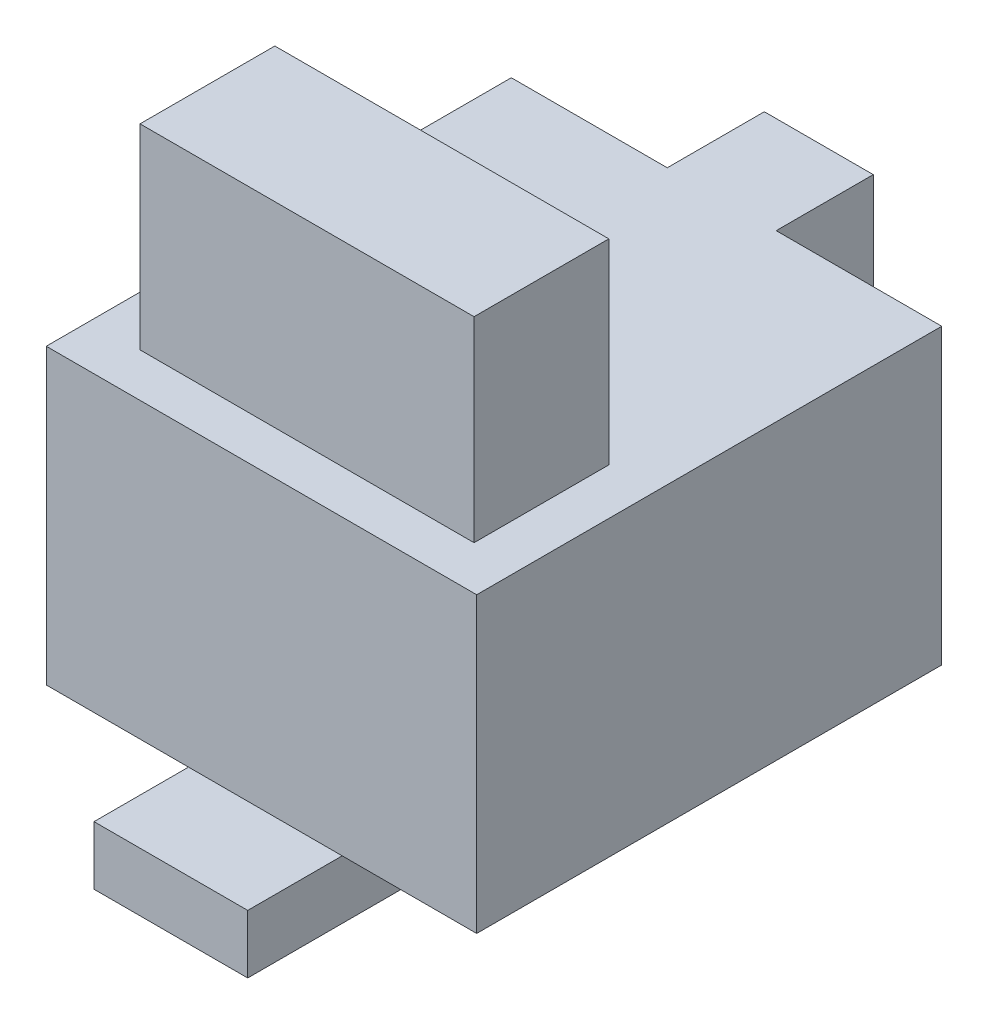
ISO-10303-21;
HEADER;
FILE_DESCRIPTION(('STEP AP214'),'2;1');
FILE_NAME('part.step','',(''),(''),'','','');
FILE_SCHEMA(('AUTOMOTIVE_DESIGN { 1 0 10303 214 1 1 1 1 }'));
ENDSEC;
DATA;
#1=APPLICATION_CONTEXT('core data for automotive mechanical design processes');
#2=APPLICATION_PROTOCOL_DEFINITION('international standard','automotive_design',2000,#1);
#3=PRODUCT_CONTEXT('',#1,'mechanical');
#4=PRODUCT('Part','Part','',(#3));
#5=PRODUCT_RELATED_PRODUCT_CATEGORY('part','',(#4));
#6=PRODUCT_DEFINITION_FORMATION('','',#4);
#7=PRODUCT_DEFINITION_CONTEXT('part definition',#1,'design');
#8=PRODUCT_DEFINITION('design','',#6,#7);
#9=PRODUCT_DEFINITION_SHAPE('','',#8);
#10=(LENGTH_UNIT() NAMED_UNIT(*) SI_UNIT(.MILLI.,.METRE.));
#11=(NAMED_UNIT(*) PLANE_ANGLE_UNIT() SI_UNIT($,.RADIAN.));
#12=(NAMED_UNIT(*) SI_UNIT($,.STERADIAN.) SOLID_ANGLE_UNIT());
#13=UNCERTAINTY_MEASURE_WITH_UNIT(LENGTH_MEASURE(1.E-05),#10,'distance_accuracy_value','');
#14=(GEOMETRIC_REPRESENTATION_CONTEXT(3) GLOBAL_UNCERTAINTY_ASSIGNED_CONTEXT((#13)) GLOBAL_UNIT_ASSIGNED_CONTEXT((#10,
#11,#12)) REPRESENTATION_CONTEXT('',''));
#15=CARTESIAN_POINT('',(0.,0.,0.));
#16=DIRECTION('',(0.,0.,1.));
#17=DIRECTION('',(1.,0.,0.));
#18=AXIS2_PLACEMENT_3D('',#15,#16,#17);
#19=CARTESIAN_POINT('',(0.,27.2,0.));
#20=DIRECTION('',(0.,-1.,0.));
#21=DIRECTION('',(0.,0.,-1.));
#22=AXIS2_PLACEMENT_3D('',#19,#20,#21);
#23=PLANE('',#22);
#24=DIRECTION('',(0.,0.,1.));
#25=VECTOR('',#24,1.);
#26=CARTESIAN_POINT('',(-19.955,27.2,-21.56));
#27=LINE('',#26,#25);
#28=CARTESIAN_POINT('',(-19.955,27.2,-21.56));
#29=VERTEX_POINT('',#28);
#30=CARTESIAN_POINT('',(-19.955,27.2,21.56));
#31=VERTEX_POINT('',#30);
#32=EDGE_CURVE('E242',#29,#31,#27,.T.);
#33=ORIENTED_EDGE('',*,*,#32,.T.);
#34=DIRECTION('',(1.,0.,0.));
#35=VECTOR('',#34,1.);
#36=CARTESIAN_POINT('',(19.955,27.2,21.56));
#37=LINE('',#36,#35);
#38=CARTESIAN_POINT('',(19.955,27.2,21.56));
#39=VERTEX_POINT('',#38);
#40=EDGE_CURVE('E245',#31,#39,#37,.T.);
#41=ORIENTED_EDGE('',*,*,#40,.T.);
#42=DIRECTION('',(0.,0.,-1.));
#43=VECTOR('',#42,1.);
#44=CARTESIAN_POINT('',(19.955,27.2,-21.56));
#45=LINE('',#44,#43);
#46=CARTESIAN_POINT('',(19.955,27.2,-21.56));
#47=VERTEX_POINT('',#46);
#48=EDGE_CURVE('E248',#39,#47,#45,.T.);
#49=ORIENTED_EDGE('',*,*,#48,.T.);
#50=DIRECTION('',(-1.,0.,0.));
#51=VECTOR('',#50,1.);
#52=CARTESIAN_POINT('',(19.955,27.2,-21.56));
#53=LINE('',#52,#51);
#54=CARTESIAN_POINT('',(4.60499999999999,27.2,-21.56));
#55=VERTEX_POINT('',#54);
#56=EDGE_CURVE('E251',#47,#55,#53,.T.);
#57=ORIENTED_EDGE('',*,*,#56,.T.);
#58=DIRECTION('',(0.,0.,1.));
#59=VECTOR('',#58,1.);
#60=CARTESIAN_POINT('',(4.605,27.2,-30.56));
#61=LINE('',#60,#59);
#62=CARTESIAN_POINT('',(4.605,27.2,-30.56));
#63=VERTEX_POINT('',#62);
#64=EDGE_CURVE('E235',#63,#55,#61,.T.);
#65=ORIENTED_EDGE('',*,*,#64,.F.);
#66=DIRECTION('',(1.,0.,0.));
#67=VECTOR('',#66,1.);
#68=CARTESIAN_POINT('',(-5.495,27.2,-30.56));
#69=LINE('',#68,#67);
#70=CARTESIAN_POINT('',(-5.495,27.2,-30.56));
#71=VERTEX_POINT('',#70);
#72=EDGE_CURVE('E215',#71,#63,#69,.T.);
#73=ORIENTED_EDGE('',*,*,#72,.F.);
#74=DIRECTION('',(0.,0.,1.));
#75=VECTOR('',#74,1.);
#76=CARTESIAN_POINT('',(-5.495,27.2,-30.56));
#77=LINE('',#76,#75);
#78=CARTESIAN_POINT('',(-5.495,27.2,-21.56));
#79=VERTEX_POINT('',#78);
#80=EDGE_CURVE('E238',#71,#79,#77,.T.);
#81=ORIENTED_EDGE('',*,*,#80,.T.);
#82=EDGE_CURVE('E250',#79,#29,#53,.T.);
#83=ORIENTED_EDGE('',*,*,#82,.T.);
#84=EDGE_LOOP('',(#33,#41,#49,#57,#65,#73,#81,#83));
#85=FACE_BOUND('',#84,.T.);
#86=DIRECTION('',(0.,0.,1.));
#87=VECTOR('',#86,1.);
#88=CARTESIAN_POINT('',(-15.315,27.2,5.0046398551843));
#89=LINE('',#88,#87);
#90=CARTESIAN_POINT('',(-15.315,27.2,5.0046398551843));
#91=VERTEX_POINT('',#90);
#92=CARTESIAN_POINT('',(-15.315,27.2,17.5046398551843));
#93=VERTEX_POINT('',#92);
#94=EDGE_CURVE('E174',#91,#93,#89,.T.);
#95=ORIENTED_EDGE('',*,*,#94,.F.);
#96=DIRECTION('',(-1.,0.,0.));
#97=VECTOR('',#96,1.);
#98=CARTESIAN_POINT('',(-15.315,27.2,5.0046398551843));
#99=LINE('',#98,#97);
#100=CARTESIAN_POINT('',(15.655,27.2,5.0046398551843));
#101=VERTEX_POINT('',#100);
#102=EDGE_CURVE('E171',#101,#91,#99,.T.);
#103=ORIENTED_EDGE('',*,*,#102,.F.);
#104=DIRECTION('',(0.,0.,-1.));
#105=VECTOR('',#104,1.);
#106=CARTESIAN_POINT('',(15.655,27.2,5.0046398551843));
#107=LINE('',#106,#105);
#108=CARTESIAN_POINT('',(15.655,27.2,17.5046398551843));
#109=VERTEX_POINT('',#108);
#110=EDGE_CURVE('E55',#109,#101,#107,.T.);
#111=ORIENTED_EDGE('',*,*,#110,.F.);
#112=DIRECTION('',(1.,0.,0.));
#113=VECTOR('',#112,1.);
#114=CARTESIAN_POINT('',(-15.315,27.2,17.5046398551843));
#115=LINE('',#114,#113);
#116=EDGE_CURVE('E50',#93,#109,#115,.T.);
#117=ORIENTED_EDGE('',*,*,#116,.F.);
#118=EDGE_LOOP('',(#95,#103,#111,#117));
#119=FACE_BOUND('',#118,.T.);
#120=ADVANCED_FACE('F33',(#85,#119),#23,.F.);
#121=CARTESIAN_POINT('',(19.955,27.2,-21.56));
#122=DIRECTION('',(0.,0.,1.));
#123=DIRECTION('',(1.,0.,0.));
#124=AXIS2_PLACEMENT_3D('',#121,#122,#123);
#125=PLANE('',#124);
#126=DIRECTION('',(0.,1.,0.));
#127=VECTOR('',#126,1.);
#128=CARTESIAN_POINT('',(-5.495,27.2,-21.56));
#129=LINE('',#128,#127);
#130=CARTESIAN_POINT('',(-5.49500000000001,12.07,-21.56));
#131=VERTEX_POINT('',#130);
#132=EDGE_CURVE('E211',#131,#79,#129,.T.);
#133=ORIENTED_EDGE('',*,*,#132,.F.);
#134=DIRECTION('',(-1.,0.,0.));
#135=VECTOR('',#134,1.);
#136=CARTESIAN_POINT('',(-5.49500000000001,12.07,-21.56));
#137=LINE('',#136,#135);
#138=CARTESIAN_POINT('',(4.60499999999999,12.07,-21.56));
#139=VERTEX_POINT('',#138);
#140=EDGE_CURVE('E216',#139,#131,#137,.T.);
#141=ORIENTED_EDGE('',*,*,#140,.F.);
#142=DIRECTION('',(0.,-1.,0.));
#143=VECTOR('',#142,1.);
#144=CARTESIAN_POINT('',(4.605,27.2,-21.56));
#145=LINE('',#144,#143);
#146=EDGE_CURVE('E225',#55,#139,#145,.T.);
#147=ORIENTED_EDGE('',*,*,#146,.F.);
#148=ORIENTED_EDGE('',*,*,#56,.F.);
#149=DIRECTION('',(0.,-1.,0.));
#150=VECTOR('',#149,1.);
#151=CARTESIAN_POINT('',(19.955,27.2,-21.56));
#152=LINE('',#151,#150);
#153=CARTESIAN_POINT('',(19.955,0.,-21.56));
#154=VERTEX_POINT('',#153);
#155=EDGE_CURVE('E267',#47,#154,#152,.T.);
#156=ORIENTED_EDGE('',*,*,#155,.T.);
#157=DIRECTION('',(-1.,0.,0.));
#158=VECTOR('',#157,1.);
#159=CARTESIAN_POINT('',(19.955,0.,-21.56));
#160=LINE('',#159,#158);
#161=CARTESIAN_POINT('',(-19.955,0.,-21.56));
#162=VERTEX_POINT('',#161);
#163=EDGE_CURVE('E246',#154,#162,#160,.T.);
#164=ORIENTED_EDGE('',*,*,#163,.T.);
#165=DIRECTION('',(0.,-1.,0.));
#166=VECTOR('',#165,1.);
#167=CARTESIAN_POINT('',(-19.955,27.2,-21.56));
#168=LINE('',#167,#166);
#169=EDGE_CURVE('E254',#29,#162,#168,.T.);
#170=ORIENTED_EDGE('',*,*,#169,.F.);
#171=ORIENTED_EDGE('',*,*,#82,.F.);
#172=EDGE_LOOP('',(#133,#141,#147,#148,#156,#164,#170,#171));
#173=FACE_BOUND('',#172,.T.);
#174=ADVANCED_FACE('F311',(#173),#125,.F.);
#175=CARTESIAN_POINT('',(-19.955,27.2,-21.56));
#176=DIRECTION('',(1.,0.,0.));
#177=DIRECTION('',(0.,0.,-1.));
#178=AXIS2_PLACEMENT_3D('',#175,#176,#177);
#179=PLANE('',#178);
#180=DIRECTION('',(0.,0.,1.));
#181=VECTOR('',#180,1.);
#182=CARTESIAN_POINT('',(-19.955,0.,-21.56));
#183=LINE('',#182,#181);
#184=CARTESIAN_POINT('',(-19.955,0.,21.56));
#185=VERTEX_POINT('',#184);
#186=EDGE_CURVE('E241',#162,#185,#183,.T.);
#187=ORIENTED_EDGE('',*,*,#186,.T.);
#188=DIRECTION('',(0.,-1.,0.));
#189=VECTOR('',#188,1.);
#190=CARTESIAN_POINT('',(-19.955,27.2,21.56));
#191=LINE('',#190,#189);
#192=EDGE_CURVE('E37',#31,#185,#191,.T.);
#193=ORIENTED_EDGE('',*,*,#192,.F.);
#194=ORIENTED_EDGE('',*,*,#32,.F.);
#195=ORIENTED_EDGE('',*,*,#169,.T.);
#196=EDGE_LOOP('',(#187,#193,#194,#195));
#197=FACE_BOUND('',#196,.T.);
#198=ADVANCED_FACE('F35',(#197),#179,.F.);
#199=CARTESIAN_POINT('',(19.955,27.2,21.56));
#200=DIRECTION('',(0.,0.,-1.));
#201=DIRECTION('',(-1.,0.,0.));
#202=AXIS2_PLACEMENT_3D('',#199,#200,#201);
#203=PLANE('',#202);
#204=DIRECTION('',(1.,0.,0.));
#205=VECTOR('',#204,1.);
#206=CARTESIAN_POINT('',(19.955,0.,21.56));
#207=LINE('',#206,#205);
#208=CARTESIAN_POINT('',(-6.765,0.,21.56));
#209=VERTEX_POINT('',#208);
#210=EDGE_CURVE('E258',#185,#209,#207,.T.);
#211=ORIENTED_EDGE('',*,*,#210,.T.);
#212=CARTESIAN_POINT('',(7.485,0.,21.56));
#213=VERTEX_POINT('',#212);
#214=EDGE_CURVE('E262',#209,#213,#207,.T.);
#215=ORIENTED_EDGE('',*,*,#214,.T.);
#216=CARTESIAN_POINT('',(19.955,0.,21.56));
#217=VERTEX_POINT('',#216);
#218=EDGE_CURVE('E257',#213,#217,#207,.T.);
#219=ORIENTED_EDGE('',*,*,#218,.T.);
#220=DIRECTION('',(0.,-1.,0.));
#221=VECTOR('',#220,1.);
#222=CARTESIAN_POINT('',(19.955,27.2,21.56));
#223=LINE('',#222,#221);
#224=EDGE_CURVE('E269',#39,#217,#223,.T.);
#225=ORIENTED_EDGE('',*,*,#224,.F.);
#226=ORIENTED_EDGE('',*,*,#40,.F.);
#227=ORIENTED_EDGE('',*,*,#192,.T.);
#228=EDGE_LOOP('',(#211,#215,#219,#225,#226,#227));
#229=FACE_BOUND('',#228,.T.);
#230=ADVANCED_FACE('F278',(#229),#203,.F.);
#231=CARTESIAN_POINT('',(19.955,27.2,-21.56));
#232=DIRECTION('',(-1.,0.,0.));
#233=DIRECTION('',(0.,0.,1.));
#234=AXIS2_PLACEMENT_3D('',#231,#232,#233);
#235=PLANE('',#234);
#236=DIRECTION('',(0.,0.,-1.));
#237=VECTOR('',#236,1.);
#238=CARTESIAN_POINT('',(19.955,0.,-21.56));
#239=LINE('',#238,#237);
#240=EDGE_CURVE('E261',#217,#154,#239,.T.);
#241=ORIENTED_EDGE('',*,*,#240,.T.);
#242=ORIENTED_EDGE('',*,*,#155,.F.);
#243=ORIENTED_EDGE('',*,*,#48,.F.);
#244=ORIENTED_EDGE('',*,*,#224,.T.);
#245=EDGE_LOOP('',(#241,#242,#243,#244));
#246=FACE_BOUND('',#245,.T.);
#247=ADVANCED_FACE('F308',(#246),#235,.F.);
#248=CARTESIAN_POINT('',(0.,0.,0.));
#249=DIRECTION('',(0.,-1.,0.));
#250=DIRECTION('',(0.,0.,-1.));
#251=AXIS2_PLACEMENT_3D('',#248,#249,#250);
#252=PLANE('',#251);
#253=DIRECTION('',(0.,0.,1.));
#254=VECTOR('',#253,1.);
#255=CARTESIAN_POINT('',(7.485,0.,15.7));
#256=LINE('',#255,#254);
#257=CARTESIAN_POINT('',(7.485,0.,15.7));
#258=VERTEX_POINT('',#257);
#259=EDGE_CURVE('E177',#258,#213,#256,.T.);
#260=ORIENTED_EDGE('',*,*,#259,.F.);
#261=DIRECTION('',(1.,0.,0.));
#262=VECTOR('',#261,1.);
#263=CARTESIAN_POINT('',(7.485,0.,15.7));
#264=LINE('',#263,#262);
#265=CARTESIAN_POINT('',(-6.765,0.,15.7));
#266=VERTEX_POINT('',#265);
#267=EDGE_CURVE('E187',#266,#258,#264,.T.);
#268=ORIENTED_EDGE('',*,*,#267,.F.);
#269=DIRECTION('',(0.,0.,-1.));
#270=VECTOR('',#269,1.);
#271=CARTESIAN_POINT('',(-6.765,0.,15.7));
#272=LINE('',#271,#270);
#273=EDGE_CURVE('E11',#209,#266,#272,.T.);
#274=ORIENTED_EDGE('',*,*,#273,.F.);
#275=ORIENTED_EDGE('',*,*,#210,.F.);
#276=ORIENTED_EDGE('',*,*,#186,.F.);
#277=ORIENTED_EDGE('',*,*,#163,.F.);
#278=ORIENTED_EDGE('',*,*,#240,.F.);
#279=ORIENTED_EDGE('',*,*,#218,.F.);
#280=EDGE_LOOP('',(#260,#268,#274,#275,#276,#277,#278,#279));
#281=FACE_BOUND('',#280,.T.);
#282=ADVANCED_FACE('F287',(#281),#252,.T.);
#283=CARTESIAN_POINT('',(-5.495,27.2,-30.56));
#284=DIRECTION('',(1.,0.,0.));
#285=DIRECTION('',(0.,1.,0.));
#286=AXIS2_PLACEMENT_3D('',#283,#284,#285);
#287=PLANE('',#286);
#288=ORIENTED_EDGE('',*,*,#132,.T.);
#289=ORIENTED_EDGE('',*,*,#80,.F.);
#290=DIRECTION('',(0.,1.,0.));
#291=VECTOR('',#290,1.);
#292=CARTESIAN_POINT('',(-5.495,27.2,-30.56));
#293=LINE('',#292,#291);
#294=CARTESIAN_POINT('',(-5.49500000000001,12.07,-30.56));
#295=VERTEX_POINT('',#294);
#296=EDGE_CURVE('E212',#295,#71,#293,.T.);
#297=ORIENTED_EDGE('',*,*,#296,.F.);
#298=DIRECTION('',(0.,0.,1.));
#299=VECTOR('',#298,1.);
#300=CARTESIAN_POINT('',(-5.49500000000001,12.07,-30.56));
#301=LINE('',#300,#299);
#302=EDGE_CURVE('E222',#295,#131,#301,.T.);
#303=ORIENTED_EDGE('',*,*,#302,.T.);
#304=EDGE_LOOP('',(#288,#289,#297,#303));
#305=FACE_BOUND('',#304,.T.);
#306=ADVANCED_FACE('F325',(#305),#287,.F.);
#307=CARTESIAN_POINT('',(4.605,27.2,-30.56));
#308=DIRECTION('',(-1.,0.,0.));
#309=DIRECTION('',(0.,-1.,0.));
#310=AXIS2_PLACEMENT_3D('',#307,#308,#309);
#311=PLANE('',#310);
#312=ORIENTED_EDGE('',*,*,#146,.T.);
#313=DIRECTION('',(0.,0.,1.));
#314=VECTOR('',#313,1.);
#315=CARTESIAN_POINT('',(4.60499999999999,12.07,-30.56));
#316=LINE('',#315,#314);
#317=CARTESIAN_POINT('',(4.60499999999999,12.07,-30.56));
#318=VERTEX_POINT('',#317);
#319=EDGE_CURVE('E232',#318,#139,#316,.T.);
#320=ORIENTED_EDGE('',*,*,#319,.F.);
#321=DIRECTION('',(0.,-1.,0.));
#322=VECTOR('',#321,1.);
#323=CARTESIAN_POINT('',(4.605,27.2,-30.56));
#324=LINE('',#323,#322);
#325=EDGE_CURVE('E218',#63,#318,#324,.T.);
#326=ORIENTED_EDGE('',*,*,#325,.F.);
#327=ORIENTED_EDGE('',*,*,#64,.T.);
#328=EDGE_LOOP('',(#312,#320,#326,#327));
#329=FACE_BOUND('',#328,.T.);
#330=ADVANCED_FACE('F316',(#329),#311,.F.);
#331=CARTESIAN_POINT('',(-5.49500000000001,12.07,-30.56));
#332=DIRECTION('',(0.,1.,0.));
#333=DIRECTION('',(-1.,0.,0.));
#334=AXIS2_PLACEMENT_3D('',#331,#332,#333);
#335=PLANE('',#334);
#336=ORIENTED_EDGE('',*,*,#140,.T.);
#337=ORIENTED_EDGE('',*,*,#302,.F.);
#338=DIRECTION('',(-1.,0.,0.));
#339=VECTOR('',#338,1.);
#340=CARTESIAN_POINT('',(-5.49500000000001,12.07,-30.56));
#341=LINE('',#340,#339);
#342=EDGE_CURVE('E220',#318,#295,#341,.T.);
#343=ORIENTED_EDGE('',*,*,#342,.F.);
#344=ORIENTED_EDGE('',*,*,#319,.T.);
#345=EDGE_LOOP('',(#336,#337,#343,#344));
#346=FACE_BOUND('',#345,.T.);
#347=ADVANCED_FACE('F327',(#346),#335,.F.);
#348=CARTESIAN_POINT('',(0.,0.,-30.56));
#349=DIRECTION('',(0.,0.,1.));
#350=DIRECTION('',(1.,0.,0.));
#351=AXIS2_PLACEMENT_3D('',#348,#349,#350);
#352=PLANE('',#351);
#353=ORIENTED_EDGE('',*,*,#296,.T.);
#354=ORIENTED_EDGE('',*,*,#72,.T.);
#355=ORIENTED_EDGE('',*,*,#325,.T.);
#356=ORIENTED_EDGE('',*,*,#342,.T.);
#357=EDGE_LOOP('',(#353,#354,#355,#356));
#358=FACE_BOUND('',#357,.T.);
#359=ADVANCED_FACE('F320',(#358),#352,.F.);
#360=CARTESIAN_POINT('',(7.485,-5.43,15.7));
#361=DIRECTION('',(-1.,0.,0.));
#362=DIRECTION('',(0.,0.,1.));
#363=AXIS2_PLACEMENT_3D('',#360,#361,#362);
#364=PLANE('',#363);
#365=ORIENTED_EDGE('',*,*,#259,.T.);
#366=CARTESIAN_POINT('',(7.485,0.,30.32));
#367=VERTEX_POINT('',#366);
#368=EDGE_CURVE('E175',#213,#367,#256,.T.);
#369=ORIENTED_EDGE('',*,*,#368,.T.);
#370=DIRECTION('',(0.,1.,0.));
#371=VECTOR('',#370,1.);
#372=CARTESIAN_POINT('',(7.485,-5.43,30.32));
#373=LINE('',#372,#371);
#374=CARTESIAN_POINT('',(7.485,-5.43,30.32));
#375=VERTEX_POINT('',#374);
#376=EDGE_CURVE('E208',#375,#367,#373,.T.);
#377=ORIENTED_EDGE('',*,*,#376,.F.);
#378=DIRECTION('',(0.,0.,1.));
#379=VECTOR('',#378,1.);
#380=CARTESIAN_POINT('',(7.485,-5.43,15.7));
#381=LINE('',#380,#379);
#382=CARTESIAN_POINT('',(7.485,-5.43,15.7));
#383=VERTEX_POINT('',#382);
#384=EDGE_CURVE('E183',#383,#375,#381,.T.);
#385=ORIENTED_EDGE('',*,*,#384,.F.);
#386=DIRECTION('',(0.,1.,0.));
#387=VECTOR('',#386,1.);
#388=CARTESIAN_POINT('',(7.485,-5.43,15.7));
#389=LINE('',#388,#387);
#390=EDGE_CURVE('E192',#383,#258,#389,.T.);
#391=ORIENTED_EDGE('',*,*,#390,.T.);
#392=EDGE_LOOP('',(#365,#369,#377,#385,#391));
#393=FACE_BOUND('',#392,.T.);
#394=ADVANCED_FACE('F334',(#393),#364,.F.);
#395=CARTESIAN_POINT('',(7.485,-5.43,30.32));
#396=DIRECTION('',(0.,0.,-1.));
#397=DIRECTION('',(-1.,0.,0.));
#398=AXIS2_PLACEMENT_3D('',#395,#396,#397);
#399=PLANE('',#398);
#400=DIRECTION('',(-1.,0.,0.));
#401=VECTOR('',#400,1.);
#402=CARTESIAN_POINT('',(7.485,0.,30.32));
#403=LINE('',#402,#401);
#404=CARTESIAN_POINT('',(-6.765,0.,30.32));
#405=VERTEX_POINT('',#404);
#406=EDGE_CURVE('E195',#367,#405,#403,.T.);
#407=ORIENTED_EDGE('',*,*,#406,.T.);
#408=DIRECTION('',(0.,1.,0.));
#409=VECTOR('',#408,1.);
#410=CARTESIAN_POINT('',(-6.765,-5.43,30.32));
#411=LINE('',#410,#409);
#412=CARTESIAN_POINT('',(-6.765,-5.43,30.32));
#413=VERTEX_POINT('',#412);
#414=EDGE_CURVE('E205',#413,#405,#411,.T.);
#415=ORIENTED_EDGE('',*,*,#414,.F.);
#416=DIRECTION('',(-1.,0.,0.));
#417=VECTOR('',#416,1.);
#418=CARTESIAN_POINT('',(7.485,-5.43,30.32));
#419=LINE('',#418,#417);
#420=EDGE_CURVE('E186',#375,#413,#419,.T.);
#421=ORIENTED_EDGE('',*,*,#420,.F.);
#422=ORIENTED_EDGE('',*,*,#376,.T.);
#423=EDGE_LOOP('',(#407,#415,#421,#422));
#424=FACE_BOUND('',#423,.T.);
#425=ADVANCED_FACE('F403',(#424),#399,.F.);
#426=CARTESIAN_POINT('',(-6.765,-5.43,15.7));
#427=DIRECTION('',(1.,0.,0.));
#428=DIRECTION('',(0.,0.,-1.));
#429=AXIS2_PLACEMENT_3D('',#426,#427,#428);
#430=PLANE('',#429);
#431=EDGE_CURVE('E43',#405,#209,#272,.T.);
#432=ORIENTED_EDGE('',*,*,#431,.T.);
#433=ORIENTED_EDGE('',*,*,#273,.T.);
#434=DIRECTION('',(0.,1.,0.));
#435=VECTOR('',#434,1.);
#436=CARTESIAN_POINT('',(-6.765,-5.43,15.7));
#437=LINE('',#436,#435);
#438=CARTESIAN_POINT('',(-6.765,-5.43,15.7));
#439=VERTEX_POINT('',#438);
#440=EDGE_CURVE('E202',#439,#266,#437,.T.);
#441=ORIENTED_EDGE('',*,*,#440,.F.);
#442=DIRECTION('',(0.,0.,-1.));
#443=VECTOR('',#442,1.);
#444=CARTESIAN_POINT('',(-6.765,-5.43,15.7));
#445=LINE('',#444,#443);
#446=EDGE_CURVE('E189',#413,#439,#445,.T.);
#447=ORIENTED_EDGE('',*,*,#446,.F.);
#448=ORIENTED_EDGE('',*,*,#414,.T.);
#449=EDGE_LOOP('',(#432,#433,#441,#447,#448));
#450=FACE_BOUND('',#449,.T.);
#451=ADVANCED_FACE('F290',(#450),#430,.F.);
#452=CARTESIAN_POINT('',(7.485,-5.43,15.7));
#453=DIRECTION('',(0.,0.,1.));
#454=DIRECTION('',(1.,0.,0.));
#455=AXIS2_PLACEMENT_3D('',#452,#453,#454);
#456=PLANE('',#455);
#457=ORIENTED_EDGE('',*,*,#267,.T.);
#458=ORIENTED_EDGE('',*,*,#390,.F.);
#459=DIRECTION('',(1.,0.,0.));
#460=VECTOR('',#459,1.);
#461=CARTESIAN_POINT('',(7.485,-5.43,15.7));
#462=LINE('',#461,#460);
#463=EDGE_CURVE('E191',#439,#383,#462,.T.);
#464=ORIENTED_EDGE('',*,*,#463,.F.);
#465=ORIENTED_EDGE('',*,*,#440,.T.);
#466=EDGE_LOOP('',(#457,#458,#464,#465));
#467=FACE_BOUND('',#466,.T.);
#468=ADVANCED_FACE('F295',(#467),#456,.F.);
#469=CARTESIAN_POINT('',(0.,-5.43,0.));
#470=DIRECTION('',(0.,-1.,0.));
#471=DIRECTION('',(0.,0.,-1.));
#472=AXIS2_PLACEMENT_3D('',#469,#470,#471);
#473=PLANE('',#472);
#474=ORIENTED_EDGE('',*,*,#384,.T.);
#475=ORIENTED_EDGE('',*,*,#420,.T.);
#476=ORIENTED_EDGE('',*,*,#446,.T.);
#477=ORIENTED_EDGE('',*,*,#463,.T.);
#478=EDGE_LOOP('',(#474,#475,#476,#477));
#479=FACE_BOUND('',#478,.T.);
#480=ADVANCED_FACE('F299',(#479),#473,.T.);
#481=CARTESIAN_POINT('',(0.,0.,0.));
#482=DIRECTION('',(0.,-1.,0.));
#483=DIRECTION('',(0.,0.,-1.));
#484=AXIS2_PLACEMENT_3D('',#481,#482,#483);
#485=PLANE('',#484);
#486=ORIENTED_EDGE('',*,*,#214,.F.);
#487=ORIENTED_EDGE('',*,*,#431,.F.);
#488=ORIENTED_EDGE('',*,*,#406,.F.);
#489=ORIENTED_EDGE('',*,*,#368,.F.);
#490=EDGE_LOOP('',(#486,#487,#488,#489));
#491=FACE_BOUND('',#490,.T.);
#492=ADVANCED_FACE('F305',(#491),#485,.F.);
#493=CARTESIAN_POINT('',(-15.315,45.35,5.0046398551843));
#494=DIRECTION('',(1.,0.,0.));
#495=DIRECTION('',(0.,0.,-1.));
#496=AXIS2_PLACEMENT_3D('',#493,#494,#495);
#497=PLANE('',#496);
#498=ORIENTED_EDGE('',*,*,#94,.T.);
#499=DIRECTION('',(0.,-1.,0.));
#500=VECTOR('',#499,1.);
#501=CARTESIAN_POINT('',(-15.315,45.35,17.5046398551843));
#502=LINE('',#501,#500);
#503=CARTESIAN_POINT('',(-15.315,45.35,17.5046398551843));
#504=VERTEX_POINT('',#503);
#505=EDGE_CURVE('E155',#504,#93,#502,.T.);
#506=ORIENTED_EDGE('',*,*,#505,.F.);
#507=DIRECTION('',(0.,0.,1.));
#508=VECTOR('',#507,1.);
#509=CARTESIAN_POINT('',(-15.315,45.35,5.0046398551843));
#510=LINE('',#509,#508);
#511=CARTESIAN_POINT('',(-15.315,45.35,5.0046398551843));
#512=VERTEX_POINT('',#511);
#513=EDGE_CURVE('E162',#512,#504,#510,.T.);
#514=ORIENTED_EDGE('',*,*,#513,.F.);
#515=DIRECTION('',(0.,-1.,0.));
#516=VECTOR('',#515,1.);
#517=CARTESIAN_POINT('',(-15.315,45.35,5.0046398551843));
#518=LINE('',#517,#516);
#519=EDGE_CURVE('E499',#512,#91,#518,.T.);
#520=ORIENTED_EDGE('',*,*,#519,.T.);
#521=EDGE_LOOP('',(#498,#506,#514,#520));
#522=FACE_BOUND('',#521,.T.);
#523=ADVANCED_FACE('F173',(#522),#497,.F.);
#524=CARTESIAN_POINT('',(-15.315,45.35,17.5046398551843));
#525=DIRECTION('',(0.,0.,-1.));
#526=DIRECTION('',(-1.,0.,0.));
#527=AXIS2_PLACEMENT_3D('',#524,#525,#526);
#528=PLANE('',#527);
#529=ORIENTED_EDGE('',*,*,#116,.T.);
#530=DIRECTION('',(0.,-1.,0.));
#531=VECTOR('',#530,1.);
#532=CARTESIAN_POINT('',(15.655,45.35,17.5046398551843));
#533=LINE('',#532,#531);
#534=CARTESIAN_POINT('',(15.655,45.35,17.5046398551843));
#535=VERTEX_POINT('',#534);
#536=EDGE_CURVE('E158',#535,#109,#533,.T.);
#537=ORIENTED_EDGE('',*,*,#536,.F.);
#538=DIRECTION('',(1.,0.,0.));
#539=VECTOR('',#538,1.);
#540=CARTESIAN_POINT('',(-15.315,45.35,17.5046398551843));
#541=LINE('',#540,#539);
#542=EDGE_CURVE('E151',#504,#535,#541,.T.);
#543=ORIENTED_EDGE('',*,*,#542,.F.);
#544=ORIENTED_EDGE('',*,*,#505,.T.);
#545=EDGE_LOOP('',(#529,#537,#543,#544));
#546=FACE_BOUND('',#545,.T.);
#547=ADVANCED_FACE('F153',(#546),#528,.F.);
#548=CARTESIAN_POINT('',(15.655,45.35,5.0046398551843));
#549=DIRECTION('',(-1.,0.,0.));
#550=DIRECTION('',(0.,0.,1.));
#551=AXIS2_PLACEMENT_3D('',#548,#549,#550);
#552=PLANE('',#551);
#553=ORIENTED_EDGE('',*,*,#110,.T.);
#554=DIRECTION('',(0.,-1.,0.));
#555=VECTOR('',#554,1.);
#556=CARTESIAN_POINT('',(15.655,45.35,5.0046398551843));
#557=LINE('',#556,#555);
#558=CARTESIAN_POINT('',(15.655,45.35,5.0046398551843));
#559=VERTEX_POINT('',#558);
#560=EDGE_CURVE('E179',#559,#101,#557,.T.);
#561=ORIENTED_EDGE('',*,*,#560,.F.);
#562=DIRECTION('',(0.,0.,-1.));
#563=VECTOR('',#562,1.);
#564=CARTESIAN_POINT('',(15.655,45.35,5.0046398551843));
#565=LINE('',#564,#563);
#566=EDGE_CURVE('E161',#535,#559,#565,.T.);
#567=ORIENTED_EDGE('',*,*,#566,.F.);
#568=ORIENTED_EDGE('',*,*,#536,.T.);
#569=EDGE_LOOP('',(#553,#561,#567,#568));
#570=FACE_BOUND('',#569,.T.);
#571=ADVANCED_FACE('F466',(#570),#552,.F.);
#572=CARTESIAN_POINT('',(-15.315,45.35,5.0046398551843));
#573=DIRECTION('',(0.,0.,1.));
#574=DIRECTION('',(1.,0.,0.));
#575=AXIS2_PLACEMENT_3D('',#572,#573,#574);
#576=PLANE('',#575);
#577=ORIENTED_EDGE('',*,*,#102,.T.);
#578=ORIENTED_EDGE('',*,*,#519,.F.);
#579=DIRECTION('',(-1.,0.,0.));
#580=VECTOR('',#579,1.);
#581=CARTESIAN_POINT('',(-15.315,45.35,5.0046398551843));
#582=LINE('',#581,#580);
#583=EDGE_CURVE('E167',#559,#512,#582,.T.);
#584=ORIENTED_EDGE('',*,*,#583,.F.);
#585=ORIENTED_EDGE('',*,*,#560,.T.);
#586=EDGE_LOOP('',(#577,#578,#584,#585));
#587=FACE_BOUND('',#586,.T.);
#588=ADVANCED_FACE('F475',(#587),#576,.F.);
#589=CARTESIAN_POINT('',(0.,45.35,0.));
#590=DIRECTION('',(0.,1.,0.));
#591=DIRECTION('',(0.,0.,1.));
#592=AXIS2_PLACEMENT_3D('',#589,#590,#591);
#593=PLANE('',#592);
#594=ORIENTED_EDGE('',*,*,#513,.T.);
#595=ORIENTED_EDGE('',*,*,#542,.T.);
#596=ORIENTED_EDGE('',*,*,#566,.T.);
#597=ORIENTED_EDGE('',*,*,#583,.T.);
#598=EDGE_LOOP('',(#594,#595,#596,#597));
#599=FACE_BOUND('',#598,.T.);
#600=ADVANCED_FACE('F165',(#599),#593,.T.);
#601=CLOSED_SHELL('',(#120,#174,#198,#230,#247,#282,#306,#330,#347,#359,#394,#425,#451,#468,
#480,#492,#523,#547,#571,#588,#600));
#602=MANIFOLD_SOLID_BREP('B2',#601);
#603=ADVANCED_BREP_SHAPE_REPRESENTATION('',(#18,#602),#14);
#604=SHAPE_DEFINITION_REPRESENTATION(#9,#603);
ENDSEC;
END-ISO-10303-21;
